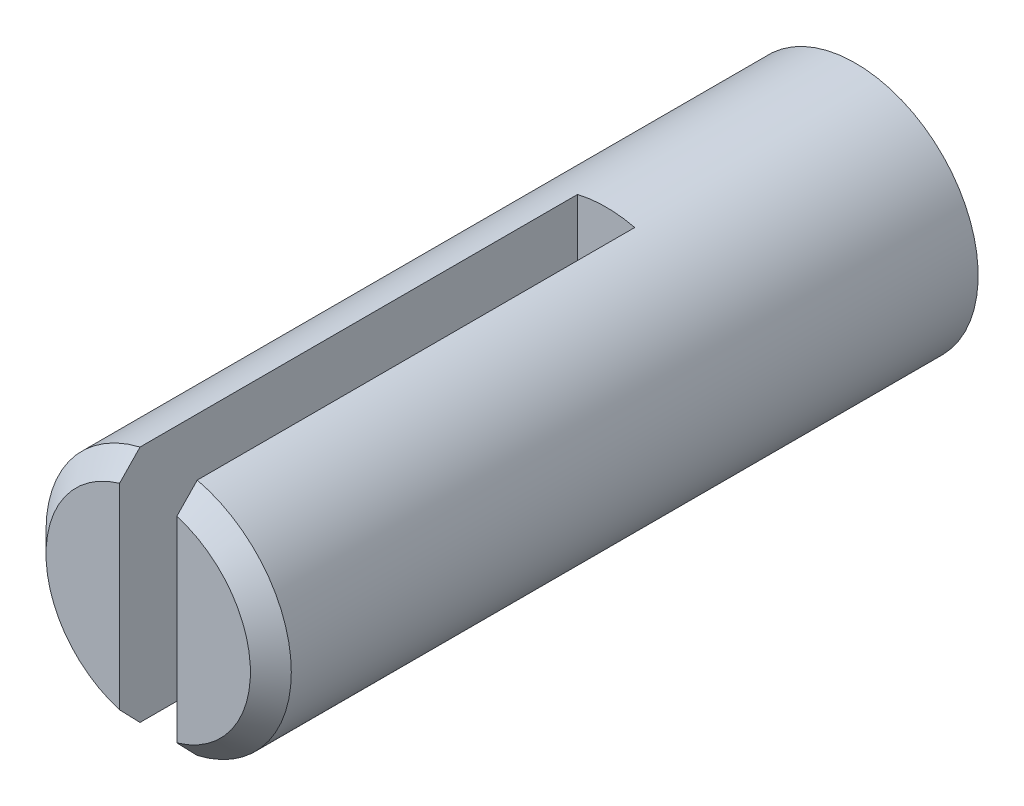
ISO-10303-21;
HEADER;
FILE_DESCRIPTION(('STEP AP214'),'2;1');
FILE_NAME('part.step','',(''),(''),'','','');
FILE_SCHEMA(('AUTOMOTIVE_DESIGN { 1 0 10303 214 1 1 1 1 }'));
ENDSEC;
DATA;
#1=APPLICATION_CONTEXT('core data for automotive mechanical design processes');
#2=APPLICATION_PROTOCOL_DEFINITION('international standard','automotive_design',2000,#1);
#3=PRODUCT_CONTEXT('',#1,'mechanical');
#4=PRODUCT('Part','Part','',(#3));
#5=PRODUCT_RELATED_PRODUCT_CATEGORY('part','',(#4));
#6=PRODUCT_DEFINITION_FORMATION('','',#4);
#7=PRODUCT_DEFINITION_CONTEXT('part definition',#1,'design');
#8=PRODUCT_DEFINITION('design','',#6,#7);
#9=PRODUCT_DEFINITION_SHAPE('','',#8);
#10=(LENGTH_UNIT() NAMED_UNIT(*) SI_UNIT(.MILLI.,.METRE.));
#11=(NAMED_UNIT(*) PLANE_ANGLE_UNIT() SI_UNIT($,.RADIAN.));
#12=(NAMED_UNIT(*) SI_UNIT($,.STERADIAN.) SOLID_ANGLE_UNIT());
#13=UNCERTAINTY_MEASURE_WITH_UNIT(LENGTH_MEASURE(1.E-05),#10,'distance_accuracy_value','');
#14=(GEOMETRIC_REPRESENTATION_CONTEXT(3) GLOBAL_UNCERTAINTY_ASSIGNED_CONTEXT((#13)) GLOBAL_UNIT_ASSIGNED_CONTEXT((#10,
#11,#12)) REPRESENTATION_CONTEXT('',''));
#15=CARTESIAN_POINT('',(0.,0.,0.));
#16=DIRECTION('',(0.,0.,1.));
#17=DIRECTION('',(1.,0.,0.));
#18=AXIS2_PLACEMENT_3D('',#15,#16,#17);
#19=CARTESIAN_POINT('',(0.,0.,0.));
#20=DIRECTION('',(0.,0.,-1.));
#21=DIRECTION('',(-1.,0.,0.));
#22=AXIS2_PLACEMENT_3D('',#19,#20,#21);
#23=PLANE('',#22);
#24=CARTESIAN_POINT('',(0.,0.,0.));
#25=DIRECTION('',(0.,0.,1.));
#26=DIRECTION('',(1.,0.,0.));
#27=AXIS2_PLACEMENT_3D('',#24,#25,#26);
#28=CIRCLE('',#27,1.75);
#29=CARTESIAN_POINT('',(1.75,0.,0.));
#30=VERTEX_POINT('',#29);
#31=EDGE_CURVE('E194',#30,#30,#28,.T.);
#32=ORIENTED_EDGE('',*,*,#31,.F.);
#33=EDGE_LOOP('',(#32));
#34=FACE_BOUND('',#33,.T.);
#35=ADVANCED_FACE('F17',(#34),#23,.T.);
#36=CARTESIAN_POINT('',(0.,0.,18.));
#37=DIRECTION('',(0.,0.,1.));
#38=DIRECTION('',(1.,0.,0.));
#39=AXIS2_PLACEMENT_3D('',#36,#37,#38);
#40=PLANE('',#39);
#41=DIRECTION('',(0.,1.,0.));
#42=VECTOR('',#41,1.);
#43=CARTESIAN_POINT('',(0.7,3.,18.000000000028));
#44=LINE('',#43,#42);
#45=CARTESIAN_POINT('',(0.7,-2.3999999999686,18.000000000057));
#46=VERTEX_POINT('',#45);
#47=CARTESIAN_POINT('',(0.7,2.39999999995201,18.0000000000729));
#48=VERTEX_POINT('',#47);
#49=EDGE_CURVE('E108',#46,#48,#44,.T.);
#50=ORIENTED_EDGE('',*,*,#49,.F.);
#51=CARTESIAN_POINT('',(0.,0.,18.0000000000859));
#52=DIRECTION('',(0.,0.,-1.));
#53=DIRECTION('',(-1.,0.,0.));
#54=AXIS2_PLACEMENT_3D('',#51,#52,#53);
#55=CIRCLE('',#54,2.49999999994088);
#56=EDGE_CURVE('E193',#48,#46,#55,.T.);
#57=ORIENTED_EDGE('',*,*,#56,.F.);
#58=EDGE_LOOP('',(#50,#57));
#59=FACE_BOUND('',#58,.T.);
#60=ADVANCED_FACE('F157',(#59),#40,.T.);
#61=CARTESIAN_POINT('',(-0.7,3.,6.800000000027));
#62=DIRECTION('',(0.,0.,-1.));
#63=DIRECTION('',(-1.,0.,0.));
#64=AXIS2_PLACEMENT_3D('',#61,#62,#63);
#65=PLANE('',#64);
#66=DIRECTION('',(0.,1.,0.));
#67=VECTOR('',#66,1.);
#68=CARTESIAN_POINT('',(0.7,3.,6.800000000027));
#69=LINE('',#68,#67);
#70=CARTESIAN_POINT('',(0.699999999999996,2.91719042916297,6.800000000027));
#71=VERTEX_POINT('',#70);
#72=CARTESIAN_POINT('',(0.700000000000791,-2.91719042916277,6.800000000027));
#73=VERTEX_POINT('',#72);
#74=EDGE_CURVE('E82',#71,#73,#69,.F.);
#75=ORIENTED_EDGE('',*,*,#74,.F.);
#76=CARTESIAN_POINT('',(0.,0.,6.800000000027));
#77=DIRECTION('',(0.,0.,-1.));
#78=DIRECTION('',(-1.,0.,0.));
#79=AXIS2_PLACEMENT_3D('',#76,#77,#78);
#80=CIRCLE('',#79,3.);
#81=CARTESIAN_POINT('',(-0.70000000000079,2.91719042916277,6.800000000027));
#82=VERTEX_POINT('',#81);
#83=EDGE_CURVE('E20',#82,#71,#80,.T.);
#84=ORIENTED_EDGE('',*,*,#83,.F.);
#85=DIRECTION('',(0.,1.,0.));
#86=VECTOR('',#85,1.);
#87=CARTESIAN_POINT('',(-0.7,-3.,6.800000000027));
#88=LINE('',#87,#86);
#89=CARTESIAN_POINT('',(-0.699999999999995,-2.91719042916297,6.800000000027));
#90=VERTEX_POINT('',#89);
#91=EDGE_CURVE('E103',#90,#82,#88,.T.);
#92=ORIENTED_EDGE('',*,*,#91,.F.);
#93=CARTESIAN_POINT('',(0.,0.,6.800000000027));
#94=DIRECTION('',(0.,0.,-1.));
#95=DIRECTION('',(-1.,0.,0.));
#96=AXIS2_PLACEMENT_3D('',#93,#94,#95);
#97=CIRCLE('',#96,3.);
#98=EDGE_CURVE('E80',#73,#90,#97,.T.);
#99=ORIENTED_EDGE('',*,*,#98,.F.);
#100=EDGE_LOOP('',(#75,#84,#92,#99));
#101=FACE_BOUND('',#100,.T.);
#102=ADVANCED_FACE('F83',(#101),#65,.F.);
#103=CARTESIAN_POINT('',(0.,0.,18.));
#104=DIRECTION('',(0.,0.,1.));
#105=DIRECTION('',(1.,0.,0.));
#106=AXIS2_PLACEMENT_3D('',#103,#104,#105);
#107=PLANE('',#106);
#108=DIRECTION('',(0.,1.,0.));
#109=VECTOR('',#108,1.);
#110=CARTESIAN_POINT('',(-0.7,-3.,18.000000000028));
#111=LINE('',#110,#109);
#112=CARTESIAN_POINT('',(-0.7,2.3999999999686,18.000000000057));
#113=VERTEX_POINT('',#112);
#114=CARTESIAN_POINT('',(-0.7,-2.3999999999686,18.000000000057));
#115=VERTEX_POINT('',#114);
#116=EDGE_CURVE('E102',#113,#115,#111,.F.);
#117=ORIENTED_EDGE('',*,*,#116,.F.);
#118=CARTESIAN_POINT('',(0.,0.,18.0000000000859));
#119=DIRECTION('',(0.,0.,-1.));
#120=DIRECTION('',(-1.,0.,0.));
#121=AXIS2_PLACEMENT_3D('',#118,#119,#120);
#122=CIRCLE('',#121,2.49999999994088);
#123=EDGE_CURVE('E117',#115,#113,#122,.T.);
#124=ORIENTED_EDGE('',*,*,#123,.F.);
#125=EDGE_LOOP('',(#117,#124));
#126=FACE_BOUND('',#125,.T.);
#127=ADVANCED_FACE('F151',(#126),#107,.T.);
#128=CARTESIAN_POINT('',(0.,0.,0.));
#129=DIRECTION('',(0.,0.,1.));
#130=DIRECTION('',(1.,0.,0.));
#131=AXIS2_PLACEMENT_3D('',#128,#129,#130);
#132=CYLINDRICAL_SURFACE('',#131,1.75);
#133=ORIENTED_EDGE('',*,*,#31,.T.);
#134=EDGE_LOOP('',(#133));
#135=FACE_BOUND('',#134,.T.);
#136=CARTESIAN_POINT('',(0.,0.,0.7));
#137=DIRECTION('',(0.,0.,1.));
#138=DIRECTION('',(1.,0.,0.));
#139=AXIS2_PLACEMENT_3D('',#136,#137,#138);
#140=CIRCLE('',#139,1.75);
#141=CARTESIAN_POINT('',(1.75,0.,0.7));
#142=VERTEX_POINT('',#141);
#143=EDGE_CURVE('E94',#142,#142,#140,.F.);
#144=ORIENTED_EDGE('',*,*,#143,.T.);
#145=EDGE_LOOP('',(#144));
#146=FACE_BOUND('',#145,.T.);
#147=ADVANCED_FACE('F146',(#135,#146),#132,.T.);
#148=CARTESIAN_POINT('',(0.,0.,17.4999999999841));
#149=DIRECTION('',(0.,0.,-1.));
#150=DIRECTION('',(-1.,0.,0.));
#151=AXIS2_PLACEMENT_3D('',#148,#149,#150);
#152=CONICAL_SURFACE('',#151,3.00000000004275,0.785398163397448);
#153=CARTESIAN_POINT('',(0.,0.,17.5));
#154=DIRECTION('',(0.,0.,-1.));
#155=DIRECTION('',(-1.,0.,0.));
#156=AXIS2_PLACEMENT_3D('',#153,#154,#155);
#157=CIRCLE('',#156,3.);
#158=CARTESIAN_POINT('',(0.7,2.91719042917167,17.5000000000009));
#159=VERTEX_POINT('',#158);
#160=CARTESIAN_POINT('',(0.700000000000791,-2.91719042917426,17.5000000000022));
#161=VERTEX_POINT('',#160);
#162=EDGE_CURVE('E97',#159,#161,#157,.T.);
#163=ORIENTED_EDGE('',*,*,#162,.F.);
#164=CARTESIAN_POINT('',(0.699999999987074,2.39999999995827,18.0000000000522));
#165=CARTESIAN_POINT('',(0.699999999994614,2.44324455317436,17.9584838795684));
#166=CARTESIAN_POINT('',(0.699999999998384,2.48644633645537,17.9169232777514));
#167=CARTESIAN_POINT('',(0.700000000001616,2.57277392958065,17.8337234573542));
#168=CARTESIAN_POINT('',(0.700000000001077,2.61589973961722,17.7920842389734));
#169=CARTESIAN_POINT('',(0.699999999997846,2.7451779217189,17.6670638289974));
#170=CARTESIAN_POINT('',(0.699999999993537,2.83123101184581,17.5835799151729));
#171=CARTESIAN_POINT('',(0.7,2.91719042918034,17.5000000000099));
#172=B_SPLINE_CURVE_WITH_KNOTS('',3,(#164,#165,#166,#167,#168,#169,#170,#171),.UNSPECIFIED.,.F.,
.F.,(4,2,2,4),(0.,0.179841809956155,0.359683164092445,0.719366013534267),.UNSPECIFIED.);
#173=EDGE_CURVE('E88',#48,#159,#172,.T.);
#174=ORIENTED_EDGE('',*,*,#173,.F.);
#175=ORIENTED_EDGE('',*,*,#56,.T.);
#176=CARTESIAN_POINT('',(0.699999999991509,-2.91719042918093,17.4999999999993));
#177=CARTESIAN_POINT('',(0.699999999997641,-2.83123101185266,17.5835799151708));
#178=CARTESIAN_POINT('',(0.699999999999528,-2.7451779217234,17.6670638289949));
#179=CARTESIAN_POINT('',(0.700000000000236,-2.61589973961878,17.792084238971));
#180=CARTESIAN_POINT('',(0.700000000000118,-2.57277392958134,17.8337234573518));
#181=CARTESIAN_POINT('',(0.699999999999882,-2.48644633645673,17.9169232777518));
#182=CARTESIAN_POINT('',(0.699999999999764,-2.44324455317729,17.9584838795714));
#183=CARTESIAN_POINT('',(0.7,-2.3999999999651,18.0000000000603));
#184=B_SPLINE_CURVE_WITH_KNOTS('',3,(#176,#177,#178,#179,#180,#181,#182,#183),.UNSPECIFIED.,.F.,
.F.,(4,2,2,4),(0.,0.359682849446089,0.539524203584496,0.719366013542764),.UNSPECIFIED.);
#185=EDGE_CURVE('E109',#161,#46,#184,.T.);
#186=ORIENTED_EDGE('',*,*,#185,.F.);
#187=EDGE_LOOP('',(#163,#174,#175,#186));
#188=FACE_BOUND('',#187,.T.);
#189=ADVANCED_FACE('F142',(#188),#152,.T.);
#190=CARTESIAN_POINT('',(0.7,3.,6.800000000027));
#191=DIRECTION('',(-1.,0.,0.));
#192=DIRECTION('',(0.,0.,1.));
#193=AXIS2_PLACEMENT_3D('',#190,#191,#192);
#194=PLANE('',#193);
#195=DIRECTION('',(0.,0.,-1.));
#196=VECTOR('',#195,1.);
#197=CARTESIAN_POINT('',(0.699999999999992,2.91719042916297,18.));
#198=LINE('',#197,#196);
#199=EDGE_CURVE('E77',#71,#159,#198,.F.);
#200=ORIENTED_EDGE('',*,*,#199,.F.);
#201=ORIENTED_EDGE('',*,*,#74,.T.);
#202=DIRECTION('',(0.,0.,-1.));
#203=VECTOR('',#202,1.);
#204=CARTESIAN_POINT('',(0.700000000001582,-2.91719042916258,18.));
#205=LINE('',#204,#203);
#206=EDGE_CURVE('E105',#161,#73,#205,.T.);
#207=ORIENTED_EDGE('',*,*,#206,.F.);
#208=ORIENTED_EDGE('',*,*,#185,.T.);
#209=ORIENTED_EDGE('',*,*,#49,.T.);
#210=ORIENTED_EDGE('',*,*,#173,.T.);
#211=EDGE_LOOP('',(#200,#201,#207,#208,#209,#210));
#212=FACE_BOUND('',#211,.T.);
#213=ADVANCED_FACE('F91',(#212),#194,.T.);
#214=CARTESIAN_POINT('',(-0.7,-3.,6.800000000027));
#215=DIRECTION('',(1.,0.,0.));
#216=DIRECTION('',(0.,0.,-1.));
#217=AXIS2_PLACEMENT_3D('',#214,#215,#216);
#218=PLANE('',#217);
#219=DIRECTION('',(0.,0.,-1.));
#220=VECTOR('',#219,1.);
#221=CARTESIAN_POINT('',(-0.69999999999999,-2.91719042916297,18.));
#222=LINE('',#221,#220);
#223=CARTESIAN_POINT('',(-0.699999999999995,-2.91719042917795,17.4999999999948));
#224=VERTEX_POINT('',#223);
#225=EDGE_CURVE('E107',#90,#224,#222,.F.);
#226=ORIENTED_EDGE('',*,*,#225,.F.);
#227=ORIENTED_EDGE('',*,*,#91,.T.);
#228=DIRECTION('',(0.,0.,-1.));
#229=VECTOR('',#228,1.);
#230=CARTESIAN_POINT('',(-0.70000000000158,2.91719042916259,18.));
#231=LINE('',#230,#229);
#232=CARTESIAN_POINT('',(-0.70000000000079,2.91719042916939,17.500000000007));
#233=VERTEX_POINT('',#232);
#234=EDGE_CURVE('E79',#233,#82,#231,.T.);
#235=ORIENTED_EDGE('',*,*,#234,.F.);
#236=CARTESIAN_POINT('',(-0.699999999992582,2.91719042917181,17.5000000000095));
#237=CARTESIAN_POINT('',(-0.699999999997939,2.8312310118447,17.5835799151789));
#238=CARTESIAN_POINT('',(-0.699999999999588,2.74517792171692,17.6670638290013));
#239=CARTESIAN_POINT('',(-0.700000000000206,2.61589973961468,17.7920842389749));
#240=CARTESIAN_POINT('',(-0.700000000000103,2.57277392957806,17.833723457355));
#241=CARTESIAN_POINT('',(-0.699999999999897,2.4864463364551,17.9169232777534));
#242=CARTESIAN_POINT('',(-0.699999999999794,2.44324455317649,17.9584838795722));
#243=CARTESIAN_POINT('',(-0.7,2.3999999999651,18.0000000000603));
#244=B_SPLINE_CURVE_WITH_KNOTS('',3,(#236,#237,#238,#239,#240,#241,#242,#243),.UNSPECIFIED.,.F.,
.F.,(4,2,2,4),(0.,0.359682849439289,0.53952420357429,0.719366013529158),.UNSPECIFIED.);
#245=EDGE_CURVE('E87',#233,#113,#244,.T.);
#246=ORIENTED_EDGE('',*,*,#245,.T.);
#247=ORIENTED_EDGE('',*,*,#116,.T.);
#248=CARTESIAN_POINT('',(-0.7,-2.91719042919294,17.4999999999977));
#249=CARTESIAN_POINT('',(-0.7,-2.83123101185803,17.5835799151684));
#250=CARTESIAN_POINT('',(-0.7,-2.74517792172463,17.6670638289943));
#251=CARTESIAN_POINT('',(-0.7,-2.61589973961503,17.7920842389743));
#252=CARTESIAN_POINT('',(-0.7,-2.57277392957613,17.8337234573567));
#253=CARTESIAN_POINT('',(-0.7,-2.48644633644861,17.9169232777597));
#254=CARTESIAN_POINT('',(-0.7,-2.44324455316771,17.9584838795809));
#255=CARTESIAN_POINT('',(-0.7,-2.39999999995385,18.0000000000711));
#256=B_SPLINE_CURVE_WITH_KNOTS('',3,(#248,#249,#250,#251,#252,#253,#254,#255),.UNSPECIFIED.,.F.,
.F.,(4,2,2,4),(0.,0.359682849458767,0.539524203603515,0.719366013568124),.UNSPECIFIED.);
#257=EDGE_CURVE('E35',#224,#115,#256,.T.);
#258=ORIENTED_EDGE('',*,*,#257,.F.);
#259=EDGE_LOOP('',(#226,#227,#235,#246,#247,#258));
#260=FACE_BOUND('',#259,.T.);
#261=ADVANCED_FACE('F122',(#260),#218,.T.);
#262=CARTESIAN_POINT('',(0.,0.,17.4999999999841));
#263=DIRECTION('',(0.,0.,-1.));
#264=DIRECTION('',(-1.,0.,0.));
#265=AXIS2_PLACEMENT_3D('',#262,#263,#264);
#266=CONICAL_SURFACE('',#265,3.00000000004275,0.785398163397448);
#267=CARTESIAN_POINT('',(0.,0.,17.499999999992));
#268=DIRECTION('',(0.,0.,-1.));
#269=DIRECTION('',(-1.,0.,0.));
#270=AXIS2_PLACEMENT_3D('',#267,#268,#269);
#271=CIRCLE('',#270,3.);
#272=EDGE_CURVE('E26',#224,#233,#271,.T.);
#273=ORIENTED_EDGE('',*,*,#272,.F.);
#274=ORIENTED_EDGE('',*,*,#257,.T.);
#275=ORIENTED_EDGE('',*,*,#123,.T.);
#276=ORIENTED_EDGE('',*,*,#245,.F.);
#277=EDGE_LOOP('',(#273,#274,#275,#276));
#278=FACE_BOUND('',#277,.T.);
#279=ADVANCED_FACE('F119',(#278),#266,.T.);
#280=CARTESIAN_POINT('',(0.,0.,0.7));
#281=DIRECTION('',(0.,0.,1.));
#282=DIRECTION('',(1.,0.,0.));
#283=AXIS2_PLACEMENT_3D('',#280,#281,#282);
#284=PLANE('',#283);
#285=ORIENTED_EDGE('',*,*,#143,.F.);
#286=EDGE_LOOP('',(#285));
#287=FACE_BOUND('',#286,.T.);
#288=CARTESIAN_POINT('',(0.,0.,0.699999999999999));
#289=DIRECTION('',(0.,0.,-1.));
#290=DIRECTION('',(-1.,0.,0.));
#291=AXIS2_PLACEMENT_3D('',#288,#289,#290);
#292=CIRCLE('',#291,3.);
#293=CARTESIAN_POINT('',(-3.,0.,0.699999999999999));
#294=VERTEX_POINT('',#293);
#295=EDGE_CURVE('E11',#294,#294,#292,.F.);
#296=ORIENTED_EDGE('',*,*,#295,.F.);
#297=EDGE_LOOP('',(#296));
#298=FACE_BOUND('',#297,.T.);
#299=ADVANCED_FACE('F167',(#287,#298),#284,.F.);
#300=CARTESIAN_POINT('',(0.,0.,18.));
#301=DIRECTION('',(0.,0.,-1.));
#302=DIRECTION('',(-1.,0.,0.));
#303=AXIS2_PLACEMENT_3D('',#300,#301,#302);
#304=CYLINDRICAL_SURFACE('',#303,3.);
#305=ORIENTED_EDGE('',*,*,#199,.T.);
#306=ORIENTED_EDGE('',*,*,#162,.T.);
#307=ORIENTED_EDGE('',*,*,#206,.T.);
#308=ORIENTED_EDGE('',*,*,#98,.T.);
#309=ORIENTED_EDGE('',*,*,#225,.T.);
#310=ORIENTED_EDGE('',*,*,#272,.T.);
#311=ORIENTED_EDGE('',*,*,#234,.T.);
#312=ORIENTED_EDGE('',*,*,#83,.T.);
#313=EDGE_LOOP('',(#305,#306,#307,#308,#309,#310,#311,#312));
#314=FACE_BOUND('',#313,.T.);
#315=ORIENTED_EDGE('',*,*,#295,.T.);
#316=EDGE_LOOP('',(#315));
#317=FACE_BOUND('',#316,.T.);
#318=ADVANCED_FACE('F73',(#314,#317),#304,.T.);
#319=CLOSED_SHELL('',(#35,#60,#102,#127,#147,#189,#213,#261,#279,#299,#318));
#320=MANIFOLD_SOLID_BREP('B1',#319);
#321=ADVANCED_BREP_SHAPE_REPRESENTATION('',(#18,#320),#14);
#322=SHAPE_DEFINITION_REPRESENTATION(#9,#321);
ENDSEC;
END-ISO-10303-21;
